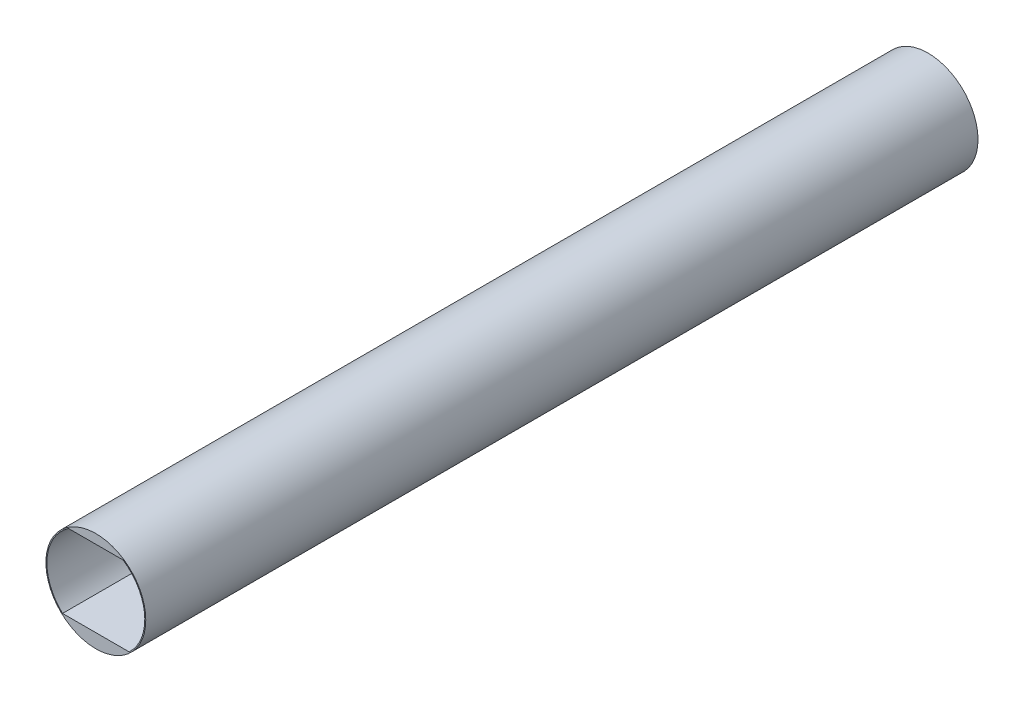
ISO-10303-21;
HEADER;
FILE_DESCRIPTION(('STEP AP214'),'2;1');
FILE_NAME('part.step','',(''),(''),'','','');
FILE_SCHEMA(('AUTOMOTIVE_DESIGN { 1 0 10303 214 1 1 1 1 }'));
ENDSEC;
DATA;
#1=APPLICATION_CONTEXT('core data for automotive mechanical design processes');
#2=APPLICATION_PROTOCOL_DEFINITION('international standard','automotive_design',2000,#1);
#3=PRODUCT_CONTEXT('',#1,'mechanical');
#4=PRODUCT('Part','Part','',(#3));
#5=PRODUCT_RELATED_PRODUCT_CATEGORY('part','',(#4));
#6=PRODUCT_DEFINITION_FORMATION('','',#4);
#7=PRODUCT_DEFINITION_CONTEXT('part definition',#1,'design');
#8=PRODUCT_DEFINITION('design','',#6,#7);
#9=PRODUCT_DEFINITION_SHAPE('','',#8);
#10=(LENGTH_UNIT() NAMED_UNIT(*) SI_UNIT(.MILLI.,.METRE.));
#11=(NAMED_UNIT(*) PLANE_ANGLE_UNIT() SI_UNIT($,.RADIAN.));
#12=(NAMED_UNIT(*) SI_UNIT($,.STERADIAN.) SOLID_ANGLE_UNIT());
#13=UNCERTAINTY_MEASURE_WITH_UNIT(LENGTH_MEASURE(1.E-05),#10,'distance_accuracy_value','');
#14=(GEOMETRIC_REPRESENTATION_CONTEXT(3) GLOBAL_UNCERTAINTY_ASSIGNED_CONTEXT((#13)) GLOBAL_UNIT_ASSIGNED_CONTEXT((#10,
#11,#12)) REPRESENTATION_CONTEXT('',''));
#15=CARTESIAN_POINT('',(0.,0.,0.));
#16=DIRECTION('',(0.,0.,1.));
#17=DIRECTION('',(1.,0.,0.));
#18=AXIS2_PLACEMENT_3D('',#15,#16,#17);
#19=CARTESIAN_POINT('',(0.,0.,-12192.));
#20=DIRECTION('',(0.,0.,1.));
#21=DIRECTION('',(1.,0.,0.));
#22=AXIS2_PLACEMENT_3D('',#19,#20,#21);
#23=CYLINDRICAL_SURFACE('',#22,914.4);
#24=CARTESIAN_POINT('',(0.,0.,-12192.));
#25=DIRECTION('',(0.,0.,1.));
#26=DIRECTION('',(1.,0.,0.));
#27=AXIS2_PLACEMENT_3D('',#24,#25,#26);
#28=CIRCLE('',#27,914.4);
#29=CARTESIAN_POINT('',(914.4,0.,-12192.));
#30=VERTEX_POINT('',#29);
#31=EDGE_CURVE('E11',#30,#30,#28,.T.);
#32=ORIENTED_EDGE('',*,*,#31,.T.);
#33=EDGE_LOOP('',(#32));
#34=FACE_BOUND('',#33,.T.);
#35=CARTESIAN_POINT('',(0.,0.,3048.));
#36=DIRECTION('',(0.,0.,1.));
#37=DIRECTION('',(1.,0.,0.));
#38=AXIS2_PLACEMENT_3D('',#35,#36,#37);
#39=CIRCLE('',#38,914.4);
#40=CARTESIAN_POINT('',(914.4,0.,3048.));
#41=VERTEX_POINT('',#40);
#42=EDGE_CURVE('E101',#41,#41,#39,.T.);
#43=ORIENTED_EDGE('',*,*,#42,.F.);
#44=EDGE_LOOP('',(#43));
#45=FACE_BOUND('',#44,.T.);
#46=ADVANCED_FACE('F35',(#34,#45),#23,.T.);
#47=CARTESIAN_POINT('',(0.,0.,-12192.));
#48=DIRECTION('',(0.,0.,1.));
#49=DIRECTION('',(1.,0.,0.));
#50=AXIS2_PLACEMENT_3D('',#47,#48,#49);
#51=PLANE('',#50);
#52=DIRECTION('',(-1.,0.,0.));
#53=VECTOR('',#52,1.);
#54=CARTESIAN_POINT('',(-500.064011902476,744.22,-12192.));
#55=LINE('',#54,#53);
#56=CARTESIAN_POINT('',(500.064011902476,744.22,-12192.));
#57=VERTEX_POINT('',#56);
#58=CARTESIAN_POINT('',(-500.064011902476,744.22,-12192.));
#59=VERTEX_POINT('',#58);
#60=EDGE_CURVE('E86',#57,#59,#55,.T.);
#61=ORIENTED_EDGE('',*,*,#60,.T.);
#62=CARTESIAN_POINT('',(0.,0.,-12192.));
#63=DIRECTION('',(0.,0.,1.));
#64=DIRECTION('',(1.,0.,0.));
#65=AXIS2_PLACEMENT_3D('',#62,#63,#64);
#66=CIRCLE('',#65,896.62);
#67=CARTESIAN_POINT('',(-609.6,-657.506855021299,-12192.));
#68=VERTEX_POINT('',#67);
#69=EDGE_CURVE('E104',#59,#68,#66,.T.);
#70=ORIENTED_EDGE('',*,*,#69,.T.);
#71=DIRECTION('',(1.,0.,0.));
#72=VECTOR('',#71,1.);
#73=CARTESIAN_POINT('',(-609.6,-657.506855021299,-12192.));
#74=LINE('',#73,#72);
#75=CARTESIAN_POINT('',(609.6,-657.506855021299,-12192.));
#76=VERTEX_POINT('',#75);
#77=EDGE_CURVE('E82',#68,#76,#74,.T.);
#78=ORIENTED_EDGE('',*,*,#77,.T.);
#79=CARTESIAN_POINT('',(0.,0.,-12192.));
#80=DIRECTION('',(0.,0.,1.));
#81=DIRECTION('',(1.,0.,0.));
#82=AXIS2_PLACEMENT_3D('',#79,#80,#81);
#83=CIRCLE('',#82,896.62);
#84=EDGE_CURVE('E49',#76,#57,#83,.T.);
#85=ORIENTED_EDGE('',*,*,#84,.T.);
#86=EDGE_LOOP('',(#61,#70,#78,#85));
#87=FACE_BOUND('',#86,.T.);
#88=ORIENTED_EDGE('',*,*,#31,.F.);
#89=EDGE_LOOP('',(#88));
#90=FACE_BOUND('',#89,.T.);
#91=ADVANCED_FACE('F115',(#87,#90),#51,.F.);
#92=CARTESIAN_POINT('',(0.,0.,-12192.));
#93=DIRECTION('',(0.,0.,1.));
#94=DIRECTION('',(1.,0.,0.));
#95=AXIS2_PLACEMENT_3D('',#92,#93,#94);
#96=CYLINDRICAL_SURFACE('',#95,896.62);
#97=DIRECTION('',(0.,0.,1.));
#98=VECTOR('',#97,1.);
#99=CARTESIAN_POINT('',(-500.064011902476,744.22,-12192.));
#100=LINE('',#99,#98);
#101=CARTESIAN_POINT('',(-500.064011902476,744.22,3048.));
#102=VERTEX_POINT('',#101);
#103=EDGE_CURVE('E42',#59,#102,#100,.T.);
#104=ORIENTED_EDGE('',*,*,#103,.T.);
#105=CARTESIAN_POINT('',(0.,0.,3048.));
#106=DIRECTION('',(0.,0.,1.));
#107=DIRECTION('',(1.,0.,0.));
#108=AXIS2_PLACEMENT_3D('',#105,#106,#107);
#109=CIRCLE('',#108,896.62);
#110=CARTESIAN_POINT('',(-609.6,-657.506855021299,3048.));
#111=VERTEX_POINT('',#110);
#112=EDGE_CURVE('E88',#102,#111,#109,.T.);
#113=ORIENTED_EDGE('',*,*,#112,.T.);
#114=DIRECTION('',(0.,0.,1.));
#115=VECTOR('',#114,1.);
#116=CARTESIAN_POINT('',(-609.6,-657.506855021299,-12192.));
#117=LINE('',#116,#115);
#118=EDGE_CURVE('E75',#68,#111,#117,.T.);
#119=ORIENTED_EDGE('',*,*,#118,.F.);
#120=ORIENTED_EDGE('',*,*,#69,.F.);
#121=EDGE_LOOP('',(#104,#113,#119,#120));
#122=FACE_BOUND('',#121,.T.);
#123=ADVANCED_FACE('F89',(#122),#96,.F.);
#124=CARTESIAN_POINT('',(-500.064011902476,744.22,-12192.));
#125=DIRECTION('',(0.,1.,0.));
#126=DIRECTION('',(0.,0.,1.));
#127=AXIS2_PLACEMENT_3D('',#124,#125,#126);
#128=PLANE('',#127);
#129=DIRECTION('',(0.,0.,1.));
#130=VECTOR('',#129,1.);
#131=CARTESIAN_POINT('',(500.064011902476,744.22,-12192.));
#132=LINE('',#131,#130);
#133=CARTESIAN_POINT('',(500.064011902476,744.22,3048.));
#134=VERTEX_POINT('',#133);
#135=EDGE_CURVE('E111',#57,#134,#132,.T.);
#136=ORIENTED_EDGE('',*,*,#135,.T.);
#137=DIRECTION('',(-1.,0.,0.));
#138=VECTOR('',#137,1.);
#139=CARTESIAN_POINT('',(-500.064011902476,744.22,3048.));
#140=LINE('',#139,#138);
#141=EDGE_CURVE('E97',#134,#102,#140,.T.);
#142=ORIENTED_EDGE('',*,*,#141,.T.);
#143=ORIENTED_EDGE('',*,*,#103,.F.);
#144=ORIENTED_EDGE('',*,*,#60,.F.);
#145=EDGE_LOOP('',(#136,#142,#143,#144));
#146=FACE_BOUND('',#145,.T.);
#147=ADVANCED_FACE('F117',(#146),#128,.F.);
#148=CARTESIAN_POINT('',(0.,0.,-12192.));
#149=DIRECTION('',(0.,0.,1.));
#150=DIRECTION('',(1.,0.,0.));
#151=AXIS2_PLACEMENT_3D('',#148,#149,#150);
#152=CYLINDRICAL_SURFACE('',#151,896.62);
#153=DIRECTION('',(0.,0.,1.));
#154=VECTOR('',#153,1.);
#155=CARTESIAN_POINT('',(609.6,-657.506855021299,-12192.));
#156=LINE('',#155,#154);
#157=CARTESIAN_POINT('',(609.6,-657.506855021299,3048.));
#158=VERTEX_POINT('',#157);
#159=EDGE_CURVE('E85',#76,#158,#156,.T.);
#160=ORIENTED_EDGE('',*,*,#159,.T.);
#161=CARTESIAN_POINT('',(0.,0.,3048.));
#162=DIRECTION('',(0.,0.,1.));
#163=DIRECTION('',(1.,0.,0.));
#164=AXIS2_PLACEMENT_3D('',#161,#162,#163);
#165=CIRCLE('',#164,896.62);
#166=EDGE_CURVE('E95',#158,#134,#165,.T.);
#167=ORIENTED_EDGE('',*,*,#166,.T.);
#168=ORIENTED_EDGE('',*,*,#135,.F.);
#169=ORIENTED_EDGE('',*,*,#84,.F.);
#170=EDGE_LOOP('',(#160,#167,#168,#169));
#171=FACE_BOUND('',#170,.T.);
#172=ADVANCED_FACE('F113',(#171),#152,.F.);
#173=CARTESIAN_POINT('',(-609.6,-657.506855021299,-12192.));
#174=DIRECTION('',(0.,-1.,0.));
#175=DIRECTION('',(0.,0.,-1.));
#176=AXIS2_PLACEMENT_3D('',#173,#174,#175);
#177=PLANE('',#176);
#178=ORIENTED_EDGE('',*,*,#118,.T.);
#179=DIRECTION('',(1.,0.,0.));
#180=VECTOR('',#179,1.);
#181=CARTESIAN_POINT('',(-609.6,-657.506855021299,3048.));
#182=LINE('',#181,#180);
#183=EDGE_CURVE('E79',#111,#158,#182,.T.);
#184=ORIENTED_EDGE('',*,*,#183,.T.);
#185=ORIENTED_EDGE('',*,*,#159,.F.);
#186=ORIENTED_EDGE('',*,*,#77,.F.);
#187=EDGE_LOOP('',(#178,#184,#185,#186));
#188=FACE_BOUND('',#187,.T.);
#189=ADVANCED_FACE('F77',(#188),#177,.F.);
#190=CARTESIAN_POINT('',(0.,0.,3048.));
#191=DIRECTION('',(0.,0.,1.));
#192=DIRECTION('',(1.,0.,0.));
#193=AXIS2_PLACEMENT_3D('',#190,#191,#192);
#194=PLANE('',#193);
#195=ORIENTED_EDGE('',*,*,#42,.T.);
#196=EDGE_LOOP('',(#195));
#197=FACE_BOUND('',#196,.T.);
#198=ORIENTED_EDGE('',*,*,#183,.F.);
#199=ORIENTED_EDGE('',*,*,#112,.F.);
#200=ORIENTED_EDGE('',*,*,#141,.F.);
#201=ORIENTED_EDGE('',*,*,#166,.F.);
#202=EDGE_LOOP('',(#198,#199,#200,#201));
#203=FACE_BOUND('',#202,.T.);
#204=ADVANCED_FACE('F93',(#197,#203),#194,.T.);
#205=CLOSED_SHELL('',(#46,#91,#123,#147,#172,#189,#204));
#206=MANIFOLD_SOLID_BREP('B2',#205);
#207=ADVANCED_BREP_SHAPE_REPRESENTATION('',(#18,#206),#14);
#208=SHAPE_DEFINITION_REPRESENTATION(#9,#207);
ENDSEC;
END-ISO-10303-21;
